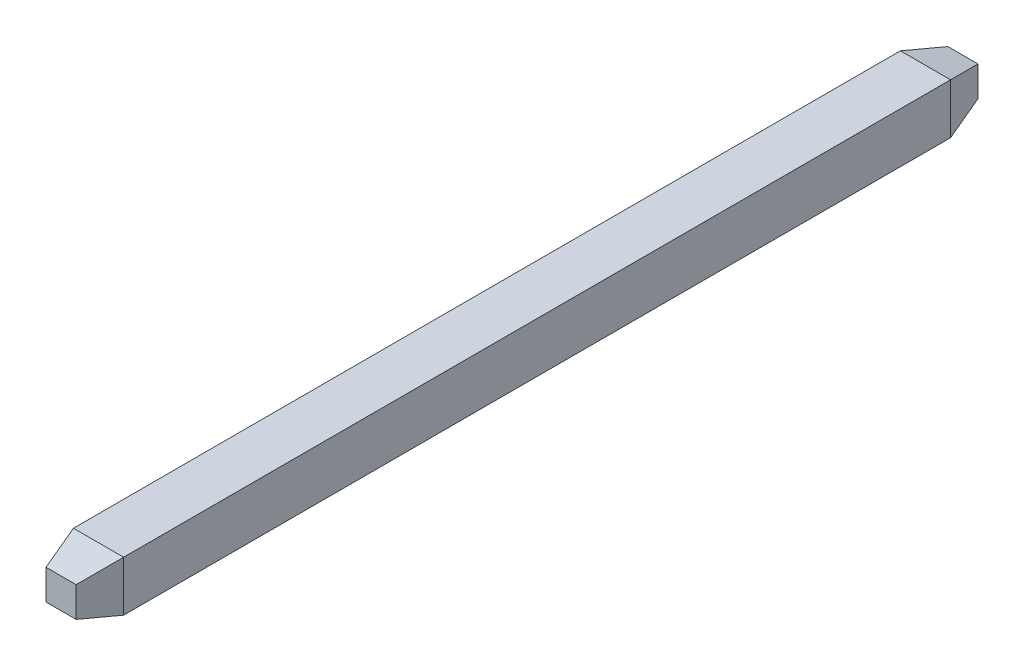
ISO-10303-21;
HEADER;
FILE_DESCRIPTION(('STEP AP214'),'2;1');
FILE_NAME('part.step','',(''),(''),'','','');
FILE_SCHEMA(('AUTOMOTIVE_DESIGN { 1 0 10303 214 1 1 1 1 }'));
ENDSEC;
DATA;
#1=APPLICATION_CONTEXT('core data for automotive mechanical design processes');
#2=APPLICATION_PROTOCOL_DEFINITION('international standard','automotive_design',2000,#1);
#3=PRODUCT_CONTEXT('',#1,'mechanical');
#4=PRODUCT('Part','Part','',(#3));
#5=PRODUCT_RELATED_PRODUCT_CATEGORY('part','',(#4));
#6=PRODUCT_DEFINITION_FORMATION('','',#4);
#7=PRODUCT_DEFINITION_CONTEXT('part definition',#1,'design');
#8=PRODUCT_DEFINITION('design','',#6,#7);
#9=PRODUCT_DEFINITION_SHAPE('','',#8);
#10=(LENGTH_UNIT() NAMED_UNIT(*) SI_UNIT(.MILLI.,.METRE.));
#11=(NAMED_UNIT(*) PLANE_ANGLE_UNIT() SI_UNIT($,.RADIAN.));
#12=(NAMED_UNIT(*) SI_UNIT($,.STERADIAN.) SOLID_ANGLE_UNIT());
#13=UNCERTAINTY_MEASURE_WITH_UNIT(LENGTH_MEASURE(1.E-05),#10,'distance_accuracy_value','');
#14=(GEOMETRIC_REPRESENTATION_CONTEXT(3) GLOBAL_UNCERTAINTY_ASSIGNED_CONTEXT((#13)) GLOBAL_UNIT_ASSIGNED_CONTEXT((#10,
#11,#12)) REPRESENTATION_CONTEXT('',''));
#15=CARTESIAN_POINT('',(0.,0.,0.));
#16=DIRECTION('',(0.,0.,1.));
#17=DIRECTION('',(1.,0.,0.));
#18=AXIS2_PLACEMENT_3D('',#15,#16,#17);
#19=CARTESIAN_POINT('',(-1.53140500673763,2.22,7.92229749663118));
#20=DIRECTION('',(0.,-0.965925826289069,0.25881904510252));
#21=DIRECTION('',(0.,-0.25881904510252,-0.965925826289069));
#22=AXIS2_PLACEMENT_3D('',#19,#20,#21);
#23=PLANE('',#22);
#24=DIRECTION('',(1.,0.,0.));
#25=VECTOR('',#24,1.);
#26=CARTESIAN_POINT('',(0.,2.348,8.4));
#27=LINE('',#26,#25);
#28=CARTESIAN_POINT('',(-0.192,2.348,8.4));
#29=VERTEX_POINT('',#28);
#30=CARTESIAN_POINT('',(0.192,2.348,8.4));
#31=VERTEX_POINT('',#30);
#32=EDGE_CURVE('E20',#29,#31,#27,.T.);
#33=ORIENTED_EDGE('',*,*,#32,.F.);
#34=DIRECTION('',(0.250562807085731,0.250562807085729,0.93511312653103));
#35=VECTOR('',#34,1.);
#36=CARTESIAN_POINT('',(-0.32,2.22,7.92229749663118));
#37=LINE('',#36,#35);
#38=CARTESIAN_POINT('',(-0.32,2.22,7.92229749663118));
#39=VERTEX_POINT('',#38);
#40=EDGE_CURVE('E110',#39,#29,#37,.T.);
#41=ORIENTED_EDGE('',*,*,#40,.F.);
#42=DIRECTION('',(1.,0.,0.));
#43=VECTOR('',#42,1.);
#44=CARTESIAN_POINT('',(-0.32,2.22,7.92229749663118));
#45=LINE('',#44,#43);
#46=CARTESIAN_POINT('',(0.32,2.22,7.92229749663118));
#47=VERTEX_POINT('',#46);
#48=EDGE_CURVE('E96',#47,#39,#45,.F.);
#49=ORIENTED_EDGE('',*,*,#48,.F.);
#50=DIRECTION('',(0.250562807085731,-0.250562807085729,-0.93511312653103));
#51=VECTOR('',#50,1.);
#52=CARTESIAN_POINT('',(0.191999999999999,2.348,8.4));
#53=LINE('',#52,#51);
#54=EDGE_CURVE('E94',#31,#47,#53,.T.);
#55=ORIENTED_EDGE('',*,*,#54,.F.);
#56=EDGE_LOOP('',(#33,#41,#49,#55));
#57=FACE_BOUND('',#56,.T.);
#58=ADVANCED_FACE('F17',(#57),#23,.T.);
#59=CARTESIAN_POINT('',(-1.53140500673763,2.22,-2.62229749663118));
#60=DIRECTION('',(0.,0.965925826289068,0.258819045102521));
#61=DIRECTION('',(0.,-0.258819045102521,0.965925826289068));
#62=AXIS2_PLACEMENT_3D('',#59,#60,#61);
#63=PLANE('',#62);
#64=DIRECTION('',(0.250562807085732,0.250562807085729,-0.93511312653103));
#65=VECTOR('',#64,1.);
#66=CARTESIAN_POINT('',(-0.32,2.22,-2.62229749663118));
#67=LINE('',#66,#65);
#68=CARTESIAN_POINT('',(-0.32,2.22,-2.62229749663118));
#69=VERTEX_POINT('',#68);
#70=CARTESIAN_POINT('',(-0.192,2.348,-3.1));
#71=VERTEX_POINT('',#70);
#72=EDGE_CURVE('E113',#69,#71,#67,.T.);
#73=ORIENTED_EDGE('',*,*,#72,.T.);
#74=DIRECTION('',(1.,0.,0.));
#75=VECTOR('',#74,1.);
#76=CARTESIAN_POINT('',(0.,2.348,-3.1));
#77=LINE('',#76,#75);
#78=CARTESIAN_POINT('',(0.192,2.348,-3.1));
#79=VERTEX_POINT('',#78);
#80=EDGE_CURVE('E79',#71,#79,#77,.T.);
#81=ORIENTED_EDGE('',*,*,#80,.T.);
#82=DIRECTION('',(0.250562807085732,-0.250562807085729,0.93511312653103));
#83=VECTOR('',#82,1.);
#84=CARTESIAN_POINT('',(0.191999999999998,2.348,-3.1));
#85=LINE('',#84,#83);
#86=CARTESIAN_POINT('',(0.32,2.22,-2.62229749663118));
#87=VERTEX_POINT('',#86);
#88=EDGE_CURVE('E108',#79,#87,#85,.T.);
#89=ORIENTED_EDGE('',*,*,#88,.T.);
#90=DIRECTION('',(1.,0.,0.));
#91=VECTOR('',#90,1.);
#92=CARTESIAN_POINT('',(-0.32,2.22,-2.62229749663118));
#93=LINE('',#92,#91);
#94=EDGE_CURVE('E118',#69,#87,#93,.T.);
#95=ORIENTED_EDGE('',*,*,#94,.F.);
#96=EDGE_LOOP('',(#73,#81,#89,#95));
#97=FACE_BOUND('',#96,.T.);
#98=ADVANCED_FACE('F281',(#97),#63,.F.);
#99=CARTESIAN_POINT('',(0.,2.54,8.4));
#100=DIRECTION('',(0.,0.,1.));
#101=DIRECTION('',(1.,0.,0.));
#102=AXIS2_PLACEMENT_3D('',#99,#100,#101);
#103=PLANE('',#102);
#104=ORIENTED_EDGE('',*,*,#32,.T.);
#105=DIRECTION('',(0.,1.,0.));
#106=VECTOR('',#105,1.);
#107=CARTESIAN_POINT('',(0.191999999999999,1.00859499326237,8.4));
#108=LINE('',#107,#106);
#109=CARTESIAN_POINT('',(0.191999999999999,2.732,8.4));
#110=VERTEX_POINT('',#109);
#111=EDGE_CURVE('E88',#110,#31,#108,.F.);
#112=ORIENTED_EDGE('',*,*,#111,.F.);
#113=DIRECTION('',(1.,0.,0.));
#114=VECTOR('',#113,1.);
#115=CARTESIAN_POINT('',(1.53140500673763,2.732,8.4));
#116=LINE('',#115,#114);
#117=CARTESIAN_POINT('',(-0.192,2.732,8.4));
#118=VERTEX_POINT('',#117);
#119=EDGE_CURVE('E124',#118,#110,#116,.T.);
#120=ORIENTED_EDGE('',*,*,#119,.F.);
#121=DIRECTION('',(0.,1.,0.));
#122=VECTOR('',#121,1.);
#123=CARTESIAN_POINT('',(-0.192,4.07140500673763,8.4));
#124=LINE('',#123,#122);
#125=EDGE_CURVE('E90',#29,#118,#124,.T.);
#126=ORIENTED_EDGE('',*,*,#125,.F.);
#127=EDGE_LOOP('',(#104,#112,#120,#126));
#128=FACE_BOUND('',#127,.T.);
#129=ADVANCED_FACE('F85',(#128),#103,.T.);
#130=CARTESIAN_POINT('',(0.32,1.00859499326237,7.92229749663118));
#131=DIRECTION('',(0.965925826289069,0.,0.25881904510252));
#132=DIRECTION('',(0.25881904510252,0.,-0.965925826289069));
#133=AXIS2_PLACEMENT_3D('',#130,#131,#132);
#134=PLANE('',#133);
#135=ORIENTED_EDGE('',*,*,#111,.T.);
#136=ORIENTED_EDGE('',*,*,#54,.T.);
#137=DIRECTION('',(0.,1.,0.));
#138=VECTOR('',#137,1.);
#139=CARTESIAN_POINT('',(0.32,2.22,7.92229749663118));
#140=LINE('',#139,#138);
#141=CARTESIAN_POINT('',(0.32,2.86,7.92229749663118));
#142=VERTEX_POINT('',#141);
#143=EDGE_CURVE('E127',#142,#47,#140,.F.);
#144=ORIENTED_EDGE('',*,*,#143,.F.);
#145=DIRECTION('',(0.250562807085731,0.25056280708573,-0.93511312653103));
#146=VECTOR('',#145,1.);
#147=CARTESIAN_POINT('',(0.191999999999999,2.732,8.4));
#148=LINE('',#147,#146);
#149=EDGE_CURVE('E102',#110,#142,#148,.T.);
#150=ORIENTED_EDGE('',*,*,#149,.F.);
#151=EDGE_LOOP('',(#135,#136,#144,#150));
#152=FACE_BOUND('',#151,.T.);
#153=ADVANCED_FACE('F100',(#152),#134,.T.);
#154=CARTESIAN_POINT('',(0.,2.54,-3.1));
#155=DIRECTION('',(0.,0.,1.));
#156=DIRECTION('',(1.,0.,0.));
#157=AXIS2_PLACEMENT_3D('',#154,#155,#156);
#158=PLANE('',#157);
#159=DIRECTION('',(0.,1.,0.));
#160=VECTOR('',#159,1.);
#161=CARTESIAN_POINT('',(0.191999999999999,1.00859499326237,-3.1));
#162=LINE('',#161,#160);
#163=CARTESIAN_POINT('',(0.191999999999999,2.732,-3.1));
#164=VERTEX_POINT('',#163);
#165=EDGE_CURVE('E106',#164,#79,#162,.F.);
#166=ORIENTED_EDGE('',*,*,#165,.T.);
#167=ORIENTED_EDGE('',*,*,#80,.F.);
#168=DIRECTION('',(0.,1.,0.));
#169=VECTOR('',#168,1.);
#170=CARTESIAN_POINT('',(-0.192,4.07140500673763,-3.1));
#171=LINE('',#170,#169);
#172=CARTESIAN_POINT('',(-0.192,2.732,-3.1));
#173=VERTEX_POINT('',#172);
#174=EDGE_CURVE('E115',#71,#173,#171,.T.);
#175=ORIENTED_EDGE('',*,*,#174,.T.);
#176=DIRECTION('',(1.,0.,0.));
#177=VECTOR('',#176,1.);
#178=CARTESIAN_POINT('',(1.53140500673763,2.732,-3.1));
#179=LINE('',#178,#177);
#180=EDGE_CURVE('E138',#173,#164,#179,.T.);
#181=ORIENTED_EDGE('',*,*,#180,.T.);
#182=EDGE_LOOP('',(#166,#167,#175,#181));
#183=FACE_BOUND('',#182,.T.);
#184=ADVANCED_FACE('F257',(#183),#158,.F.);
#185=CARTESIAN_POINT('',(0.32,1.00859499326237,-2.62229749663118));
#186=DIRECTION('',(-0.965925826289068,0.,0.258819045102521));
#187=DIRECTION('',(0.258819045102521,0.,0.965925826289068));
#188=AXIS2_PLACEMENT_3D('',#185,#186,#187);
#189=PLANE('',#188);
#190=ORIENTED_EDGE('',*,*,#88,.F.);
#191=ORIENTED_EDGE('',*,*,#165,.F.);
#192=DIRECTION('',(0.250562807085731,0.250562807085732,0.935113126531029));
#193=VECTOR('',#192,1.);
#194=CARTESIAN_POINT('',(0.191999999999999,2.732,-3.1));
#195=LINE('',#194,#193);
#196=CARTESIAN_POINT('',(0.32,2.86,-2.62229749663118));
#197=VERTEX_POINT('',#196);
#198=EDGE_CURVE('E140',#164,#197,#195,.T.);
#199=ORIENTED_EDGE('',*,*,#198,.T.);
#200=DIRECTION('',(0.,1.,0.));
#201=VECTOR('',#200,1.);
#202=CARTESIAN_POINT('',(0.32,2.22,-2.62229749663118));
#203=LINE('',#202,#201);
#204=EDGE_CURVE('E133',#87,#197,#203,.T.);
#205=ORIENTED_EDGE('',*,*,#204,.F.);
#206=EDGE_LOOP('',(#190,#191,#199,#205));
#207=FACE_BOUND('',#206,.T.);
#208=ADVANCED_FACE('F249',(#207),#189,.F.);
#209=CARTESIAN_POINT('',(-0.320000000000001,4.07140500673763,7.92229749663118));
#210=DIRECTION('',(-0.965925826289069,0.,0.25881904510252));
#211=DIRECTION('',(0.25881904510252,0.,0.965925826289069));
#212=AXIS2_PLACEMENT_3D('',#209,#210,#211);
#213=PLANE('',#212);
#214=ORIENTED_EDGE('',*,*,#125,.T.);
#215=DIRECTION('',(0.25056280708573,-0.250562807085731,0.93511312653103));
#216=VECTOR('',#215,1.);
#217=CARTESIAN_POINT('',(-0.320000000000001,2.86,7.92229749663118));
#218=LINE('',#217,#216);
#219=CARTESIAN_POINT('',(-0.320000000000001,2.86,7.92229749663118));
#220=VERTEX_POINT('',#219);
#221=EDGE_CURVE('E121',#220,#118,#218,.T.);
#222=ORIENTED_EDGE('',*,*,#221,.F.);
#223=DIRECTION('',(0.,-1.,0.));
#224=VECTOR('',#223,1.);
#225=CARTESIAN_POINT('',(-0.320000000000001,2.86,7.92229749663118));
#226=LINE('',#225,#224);
#227=EDGE_CURVE('E142',#39,#220,#226,.F.);
#228=ORIENTED_EDGE('',*,*,#227,.F.);
#229=ORIENTED_EDGE('',*,*,#40,.T.);
#230=EDGE_LOOP('',(#214,#222,#228,#229));
#231=FACE_BOUND('',#230,.T.);
#232=ADVANCED_FACE('F171',(#231),#213,.T.);
#233=CARTESIAN_POINT('',(-0.320000000000001,4.07140500673763,-2.62229749663118));
#234=DIRECTION('',(0.965925826289068,0.,0.258819045102521));
#235=DIRECTION('',(0.258819045102521,0.,-0.965925826289068));
#236=AXIS2_PLACEMENT_3D('',#233,#234,#235);
#237=PLANE('',#236);
#238=DIRECTION('',(0.25056280708573,-0.250562807085732,-0.93511312653103));
#239=VECTOR('',#238,1.);
#240=CARTESIAN_POINT('',(-0.320000000000001,2.86,-2.62229749663118));
#241=LINE('',#240,#239);
#242=CARTESIAN_POINT('',(-0.320000000000001,2.86,-2.62229749663118));
#243=VERTEX_POINT('',#242);
#244=EDGE_CURVE('E136',#243,#173,#241,.T.);
#245=ORIENTED_EDGE('',*,*,#244,.T.);
#246=ORIENTED_EDGE('',*,*,#174,.F.);
#247=ORIENTED_EDGE('',*,*,#72,.F.);
#248=DIRECTION('',(0.,-1.,0.));
#249=VECTOR('',#248,1.);
#250=CARTESIAN_POINT('',(-0.320000000000001,2.86,-2.62229749663118));
#251=LINE('',#250,#249);
#252=EDGE_CURVE('E35',#243,#69,#251,.T.);
#253=ORIENTED_EDGE('',*,*,#252,.F.);
#254=EDGE_LOOP('',(#245,#246,#247,#253));
#255=FACE_BOUND('',#254,.T.);
#256=ADVANCED_FACE('F188',(#255),#237,.F.);
#257=CARTESIAN_POINT('',(-0.32,2.22,-3.1));
#258=DIRECTION('',(0.,-1.,0.));
#259=DIRECTION('',(1.,0.,0.));
#260=AXIS2_PLACEMENT_3D('',#257,#258,#259);
#261=PLANE('',#260);
#262=ORIENTED_EDGE('',*,*,#94,.T.);
#263=DIRECTION('',(0.,0.,1.));
#264=VECTOR('',#263,1.);
#265=CARTESIAN_POINT('',(0.32,2.22,-3.1));
#266=LINE('',#265,#264);
#267=EDGE_CURVE('E130',#47,#87,#266,.F.);
#268=ORIENTED_EDGE('',*,*,#267,.F.);
#269=ORIENTED_EDGE('',*,*,#48,.T.);
#270=DIRECTION('',(0.,0.,1.));
#271=VECTOR('',#270,1.);
#272=CARTESIAN_POINT('',(-0.320000000000001,2.22,-3.1));
#273=LINE('',#272,#271);
#274=EDGE_CURVE('E146',#69,#39,#273,.T.);
#275=ORIENTED_EDGE('',*,*,#274,.F.);
#276=EDGE_LOOP('',(#262,#268,#269,#275));
#277=FACE_BOUND('',#276,.T.);
#278=ADVANCED_FACE('F174',(#277),#261,.T.);
#279=CARTESIAN_POINT('',(1.53140500673763,2.86,7.92229749663118));
#280=DIRECTION('',(0.,0.965925826289069,0.25881904510252));
#281=DIRECTION('',(0.,-0.25881904510252,0.965925826289069));
#282=AXIS2_PLACEMENT_3D('',#279,#280,#281);
#283=PLANE('',#282);
#284=ORIENTED_EDGE('',*,*,#119,.T.);
#285=ORIENTED_EDGE('',*,*,#149,.T.);
#286=DIRECTION('',(-1.,0.,0.));
#287=VECTOR('',#286,1.);
#288=CARTESIAN_POINT('',(0.32,2.86,7.92229749663118));
#289=LINE('',#288,#287);
#290=EDGE_CURVE('E149',#220,#142,#289,.F.);
#291=ORIENTED_EDGE('',*,*,#290,.F.);
#292=ORIENTED_EDGE('',*,*,#221,.T.);
#293=EDGE_LOOP('',(#284,#285,#291,#292));
#294=FACE_BOUND('',#293,.T.);
#295=ADVANCED_FACE('F179',(#294),#283,.T.);
#296=CARTESIAN_POINT('',(0.32,2.22,-3.1));
#297=DIRECTION('',(1.,0.,0.));
#298=DIRECTION('',(0.,1.,0.));
#299=AXIS2_PLACEMENT_3D('',#296,#297,#298);
#300=PLANE('',#299);
#301=ORIENTED_EDGE('',*,*,#204,.T.);
#302=DIRECTION('',(0.,0.,1.));
#303=VECTOR('',#302,1.);
#304=CARTESIAN_POINT('',(0.32,2.86,-3.1));
#305=LINE('',#304,#303);
#306=EDGE_CURVE('E152',#142,#197,#305,.F.);
#307=ORIENTED_EDGE('',*,*,#306,.F.);
#308=ORIENTED_EDGE('',*,*,#143,.T.);
#309=ORIENTED_EDGE('',*,*,#267,.T.);
#310=EDGE_LOOP('',(#301,#307,#308,#309));
#311=FACE_BOUND('',#310,.T.);
#312=ADVANCED_FACE('F177',(#311),#300,.T.);
#313=CARTESIAN_POINT('',(1.53140500673763,2.86,-2.62229749663118));
#314=DIRECTION('',(0.,-0.965925826289068,0.258819045102521));
#315=DIRECTION('',(0.,-0.258819045102521,-0.965925826289068));
#316=AXIS2_PLACEMENT_3D('',#313,#314,#315);
#317=PLANE('',#316);
#318=ORIENTED_EDGE('',*,*,#198,.F.);
#319=ORIENTED_EDGE('',*,*,#180,.F.);
#320=ORIENTED_EDGE('',*,*,#244,.F.);
#321=DIRECTION('',(-1.,0.,0.));
#322=VECTOR('',#321,1.);
#323=CARTESIAN_POINT('',(0.32,2.86,-2.62229749663118));
#324=LINE('',#323,#322);
#325=EDGE_CURVE('E26',#197,#243,#324,.T.);
#326=ORIENTED_EDGE('',*,*,#325,.F.);
#327=EDGE_LOOP('',(#318,#319,#320,#326));
#328=FACE_BOUND('',#327,.T.);
#329=ADVANCED_FACE('F163',(#328),#317,.F.);
#330=CARTESIAN_POINT('',(-0.320000000000001,2.86,-3.1));
#331=DIRECTION('',(-1.,0.,0.));
#332=DIRECTION('',(0.,-1.,0.));
#333=AXIS2_PLACEMENT_3D('',#330,#331,#332);
#334=PLANE('',#333);
#335=ORIENTED_EDGE('',*,*,#252,.T.);
#336=ORIENTED_EDGE('',*,*,#274,.T.);
#337=ORIENTED_EDGE('',*,*,#227,.T.);
#338=DIRECTION('',(0.,0.,1.));
#339=VECTOR('',#338,1.);
#340=CARTESIAN_POINT('',(-0.320000000000001,2.86,-3.1));
#341=LINE('',#340,#339);
#342=EDGE_CURVE('E11',#243,#220,#341,.T.);
#343=ORIENTED_EDGE('',*,*,#342,.F.);
#344=EDGE_LOOP('',(#335,#336,#337,#343));
#345=FACE_BOUND('',#344,.T.);
#346=ADVANCED_FACE('F167',(#345),#334,.T.);
#347=CARTESIAN_POINT('',(0.32,2.86,-3.1));
#348=DIRECTION('',(0.,1.,0.));
#349=DIRECTION('',(-1.,0.,0.));
#350=AXIS2_PLACEMENT_3D('',#347,#348,#349);
#351=PLANE('',#350);
#352=ORIENTED_EDGE('',*,*,#325,.T.);
#353=ORIENTED_EDGE('',*,*,#342,.T.);
#354=ORIENTED_EDGE('',*,*,#290,.T.);
#355=ORIENTED_EDGE('',*,*,#306,.T.);
#356=EDGE_LOOP('',(#352,#353,#354,#355));
#357=FACE_BOUND('',#356,.T.);
#358=ADVANCED_FACE('F158',(#357),#351,.T.);
#359=CLOSED_SHELL('',(#58,#98,#129,#153,#184,#208,#232,#256,#278,#295,#312,#329,#346,#358));
#360=MANIFOLD_SOLID_BREP('B1',#359);
#361=ADVANCED_BREP_SHAPE_REPRESENTATION('',(#18,#360),#14);
#362=SHAPE_DEFINITION_REPRESENTATION(#9,#361);
ENDSEC;
END-ISO-10303-21;
